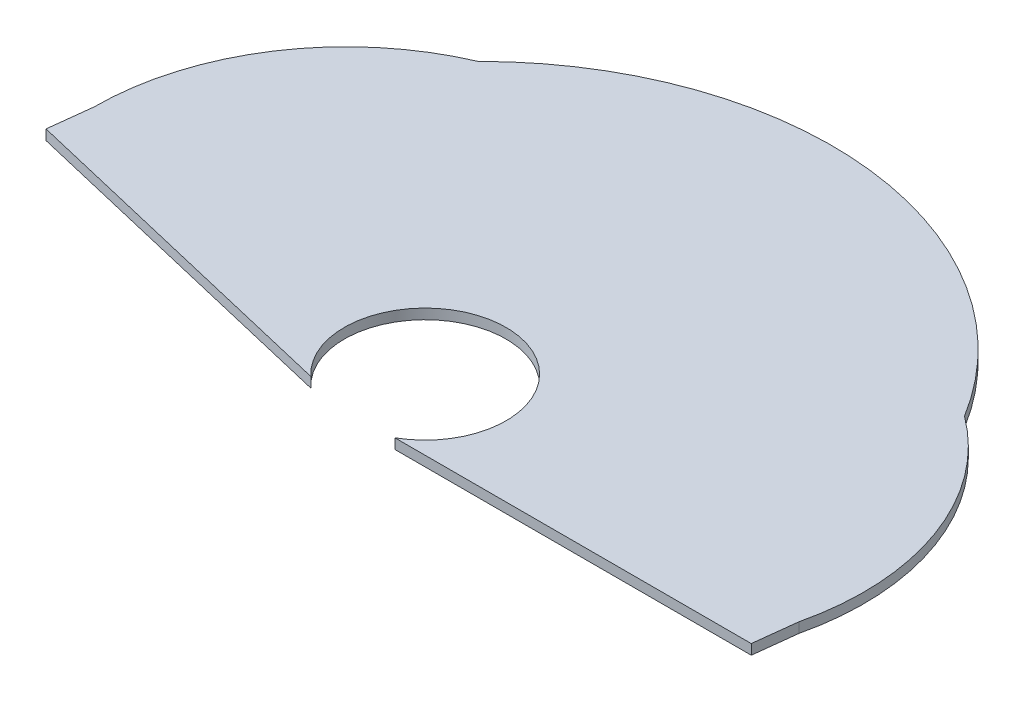
ISO-10303-21;
HEADER;
FILE_DESCRIPTION(('STEP AP214'),'2;1');
FILE_NAME('part.step','',(''),(''),'','','');
FILE_SCHEMA(('AUTOMOTIVE_DESIGN { 1 0 10303 214 1 1 1 1 }'));
ENDSEC;
DATA;
#1=APPLICATION_CONTEXT('core data for automotive mechanical design processes');
#2=APPLICATION_PROTOCOL_DEFINITION('international standard','automotive_design',2000,#1);
#3=PRODUCT_CONTEXT('',#1,'mechanical');
#4=PRODUCT('Part','Part','',(#3));
#5=PRODUCT_RELATED_PRODUCT_CATEGORY('part','',(#4));
#6=PRODUCT_DEFINITION_FORMATION('','',#4);
#7=PRODUCT_DEFINITION_CONTEXT('part definition',#1,'design');
#8=PRODUCT_DEFINITION('design','',#6,#7);
#9=PRODUCT_DEFINITION_SHAPE('','',#8);
#10=(LENGTH_UNIT() NAMED_UNIT(*) SI_UNIT(.MILLI.,.METRE.));
#11=(NAMED_UNIT(*) PLANE_ANGLE_UNIT() SI_UNIT($,.RADIAN.));
#12=(NAMED_UNIT(*) SI_UNIT($,.STERADIAN.) SOLID_ANGLE_UNIT());
#13=UNCERTAINTY_MEASURE_WITH_UNIT(LENGTH_MEASURE(1.E-05),#10,'distance_accuracy_value','');
#14=(GEOMETRIC_REPRESENTATION_CONTEXT(3) GLOBAL_UNCERTAINTY_ASSIGNED_CONTEXT((#13)) GLOBAL_UNIT_ASSIGNED_CONTEXT((#10,
#11,#12)) REPRESENTATION_CONTEXT('',''));
#15=CARTESIAN_POINT('',(0.,0.,0.));
#16=DIRECTION('',(0.,0.,1.));
#17=DIRECTION('',(1.,0.,0.));
#18=AXIS2_PLACEMENT_3D('',#15,#16,#17);
#19=CARTESIAN_POINT('',(12.47,0.5,0.));
#20=DIRECTION('',(0.,-1.,0.));
#21=DIRECTION('',(0.,0.,-1.));
#22=AXIS2_PLACEMENT_3D('',#19,#20,#21);
#23=CYLINDRICAL_SURFACE('',#22,12.47);
#24=CARTESIAN_POINT('',(12.47,0.,0.));
#25=DIRECTION('',(0.,1.,0.));
#26=DIRECTION('',(0.,0.,1.));
#27=AXIS2_PLACEMENT_3D('',#24,#25,#26);
#28=CIRCLE('',#27,12.47);
#29=CARTESIAN_POINT('',(7.54800553852922,0.,-11.4575246245099));
#30=VERTEX_POINT('',#29);
#31=CARTESIAN_POINT('',(0.,0.,0.));
#32=VERTEX_POINT('',#31);
#33=EDGE_CURVE('E152',#30,#32,#28,.T.);
#34=ORIENTED_EDGE('',*,*,#33,.T.);
#35=DIRECTION('',(0.,-1.,0.));
#36=VECTOR('',#35,1.);
#37=CARTESIAN_POINT('',(0.,0.5,0.));
#38=LINE('',#37,#36);
#39=CARTESIAN_POINT('',(0.,0.5,0.));
#40=VERTEX_POINT('',#39);
#41=EDGE_CURVE('E11',#40,#32,#38,.T.);
#42=ORIENTED_EDGE('',*,*,#41,.F.);
#43=CARTESIAN_POINT('',(12.47,0.5,0.));
#44=DIRECTION('',(0.,1.,0.));
#45=DIRECTION('',(0.,0.,1.));
#46=AXIS2_PLACEMENT_3D('',#43,#44,#45);
#47=CIRCLE('',#46,12.47);
#48=CARTESIAN_POINT('',(7.54800553852922,0.5,-11.4575246245099));
#49=VERTEX_POINT('',#48);
#50=EDGE_CURVE('E79',#49,#40,#47,.T.);
#51=ORIENTED_EDGE('',*,*,#50,.F.);
#52=DIRECTION('',(0.,-1.,0.));
#53=VECTOR('',#52,1.);
#54=CARTESIAN_POINT('',(7.54800553852922,0.5,-11.4575246245099));
#55=LINE('',#54,#53);
#56=EDGE_CURVE('E160',#49,#30,#55,.T.);
#57=ORIENTED_EDGE('',*,*,#56,.T.);
#58=EDGE_LOOP('',(#34,#42,#51,#57));
#59=FACE_BOUND('',#58,.T.);
#60=ADVANCED_FACE('F35',(#59),#23,.T.);
#61=CARTESIAN_POINT('',(27.3280369120115,0.5,1.73227452102643));
#62=DIRECTION('',(0.,-1.,0.));
#63=DIRECTION('',(0.,0.,-1.));
#64=AXIS2_PLACEMENT_3D('',#61,#62,#63);
#65=CYLINDRICAL_SURFACE('',#64,12.47);
#66=CARTESIAN_POINT('',(27.3280369120115,0.,1.73227452102643));
#67=DIRECTION('',(0.,1.,0.));
#68=DIRECTION('',(0.,0.,1.));
#69=AXIS2_PLACEMENT_3D('',#66,#67,#68);
#70=CIRCLE('',#69,12.47);
#71=CARTESIAN_POINT('',(39.4635774555418,0.,4.6009947437621));
#72=VERTEX_POINT('',#71);
#73=CARTESIAN_POINT('',(34.7538184625354,0.,-8.2856428455672));
#74=VERTEX_POINT('',#73);
#75=EDGE_CURVE('E68',#72,#74,#70,.T.);
#76=ORIENTED_EDGE('',*,*,#75,.T.);
#77=DIRECTION('',(0.,-1.,0.));
#78=VECTOR('',#77,1.);
#79=CARTESIAN_POINT('',(34.7538184625354,0.5,-8.2856428455672));
#80=LINE('',#79,#78);
#81=CARTESIAN_POINT('',(34.7538184625354,0.5,-8.2856428455672));
#82=VERTEX_POINT('',#81);
#83=EDGE_CURVE('E165',#82,#74,#80,.T.);
#84=ORIENTED_EDGE('',*,*,#83,.F.);
#85=CARTESIAN_POINT('',(27.3280369120115,0.5,1.73227452102643));
#86=DIRECTION('',(0.,1.,0.));
#87=DIRECTION('',(0.,0.,1.));
#88=AXIS2_PLACEMENT_3D('',#85,#86,#87);
#89=CIRCLE('',#88,12.47);
#90=CARTESIAN_POINT('',(39.4635774555418,0.5,4.6009947437621));
#91=VERTEX_POINT('',#90);
#92=EDGE_CURVE('E157',#91,#82,#89,.T.);
#93=ORIENTED_EDGE('',*,*,#92,.F.);
#94=DIRECTION('',(0.,-1.,0.));
#95=VECTOR('',#94,1.);
#96=CARTESIAN_POINT('',(39.4635774555418,0.5,4.6009947437621));
#97=LINE('',#96,#95);
#98=EDGE_CURVE('E43',#91,#72,#97,.T.);
#99=ORIENTED_EDGE('',*,*,#98,.T.);
#100=EDGE_LOOP('',(#76,#84,#93,#99));
#101=FACE_BOUND('',#100,.T.);
#102=ADVANCED_FACE('F167',(#101),#65,.T.);
#103=CARTESIAN_POINT('',(19.9027742115382,0.5,0.833923455105282));
#104=DIRECTION('',(0.,-1.,0.));
#105=DIRECTION('',(0.,0.,-1.));
#106=AXIS2_PLACEMENT_3D('',#103,#104,#105);
#107=CYLINDRICAL_SURFACE('',#106,17.4275645130764);
#108=CARTESIAN_POINT('',(19.9027742115382,0.,0.833923455105282));
#109=DIRECTION('',(0.,1.,0.));
#110=DIRECTION('',(0.,0.,-1.));
#111=AXIS2_PLACEMENT_3D('',#108,#109,#110);
#112=CIRCLE('',#111,17.4275645130764);
#113=EDGE_CURVE('E74',#74,#30,#112,.T.);
#114=ORIENTED_EDGE('',*,*,#113,.T.);
#115=ORIENTED_EDGE('',*,*,#56,.F.);
#116=CARTESIAN_POINT('',(19.9027742115382,0.5,0.833923455105282));
#117=DIRECTION('',(0.,1.,0.));
#118=DIRECTION('',(0.,0.,-1.));
#119=AXIS2_PLACEMENT_3D('',#116,#117,#118);
#120=CIRCLE('',#119,17.4275645130764);
#121=EDGE_CURVE('E51',#82,#49,#120,.T.);
#122=ORIENTED_EDGE('',*,*,#121,.F.);
#123=ORIENTED_EDGE('',*,*,#83,.T.);
#124=EDGE_LOOP('',(#114,#115,#122,#123));
#125=FACE_BOUND('',#124,.T.);
#126=ADVANCED_FACE('F180',(#125),#107,.T.);
#127=CARTESIAN_POINT('',(12.47,0.5,0.));
#128=DIRECTION('',(0.,1.,0.));
#129=DIRECTION('',(0.,0.,1.));
#130=AXIS2_PLACEMENT_3D('',#127,#128,#129);
#131=PLANE('',#130);
#132=DIRECTION('',(-0.115803987890991,0.,0.993272085779392));
#133=VECTOR('',#132,1.);
#134=CARTESIAN_POINT('',(39.4635774555418,0.5,4.60099474376226));
#135=LINE('',#134,#133);
#136=CARTESIAN_POINT('',(39.2168599821422,0.5,6.71713585310354));
#137=VERTEX_POINT('',#136);
#138=EDGE_CURVE('E140',#91,#137,#135,.T.);
#139=ORIENTED_EDGE('',*,*,#138,.F.);
#140=ORIENTED_EDGE('',*,*,#92,.T.);
#141=ORIENTED_EDGE('',*,*,#121,.T.);
#142=ORIENTED_EDGE('',*,*,#50,.T.);
#143=DIRECTION('',(-0.115803987891,0.,0.993272085779391));
#144=VECTOR('',#143,1.);
#145=CARTESIAN_POINT('',(0.,0.5,0.));
#146=LINE('',#145,#144);
#147=CARTESIAN_POINT('',(-0.246717473399619,0.5,2.11614110934175));
#148=VERTEX_POINT('',#147);
#149=EDGE_CURVE('E143',#40,#148,#146,.T.);
#150=ORIENTED_EDGE('',*,*,#149,.T.);
#151=DIRECTION('',(-0.973178872777091,0.,-0.230049737188094));
#152=VECTOR('',#151,1.);
#153=CARTESIAN_POINT('',(-0.486817706056994,0.5,2.05938381942648));
#154=LINE('',#153,#152);
#155=CARTESIAN_POINT('',(16.8970275713044,0.5,6.16875070895151));
#156=VERTEX_POINT('',#155);
#157=EDGE_CURVE('E125',#156,#148,#154,.T.);
#158=ORIENTED_EDGE('',*,*,#157,.F.);
#159=CARTESIAN_POINT('',(19.6221739397607,0.5,3.24068355287576));
#160=DIRECTION('',(0.,1.,0.));
#161=DIRECTION('',(0.,0.,1.));
#162=AXIS2_PLACEMENT_3D('',#159,#160,#161);
#163=CIRCLE('',#162,4.);
#164=CARTESIAN_POINT('',(21.6006277310432,0.5,6.71713585310362));
#165=VERTEX_POINT('',#164);
#166=EDGE_CURVE('E146',#165,#156,#163,.T.);
#167=ORIENTED_EDGE('',*,*,#166,.F.);
#168=DIRECTION('',(1.,0.,0.));
#169=VECTOR('',#168,1.);
#170=CARTESIAN_POINT('',(0.,0.5,6.71713585310371));
#171=LINE('',#170,#169);
#172=EDGE_CURVE('E134',#165,#137,#171,.T.);
#173=ORIENTED_EDGE('',*,*,#172,.T.);
#174=EDGE_LOOP('',(#139,#140,#141,#142,#150,#158,#167,#173));
#175=FACE_BOUND('',#174,.T.);
#176=ADVANCED_FACE('F179',(#175),#131,.T.);
#177=CARTESIAN_POINT('',(12.47,0.,0.));
#178=DIRECTION('',(0.,1.,0.));
#179=DIRECTION('',(0.,0.,1.));
#180=AXIS2_PLACEMENT_3D('',#177,#178,#179);
#181=PLANE('',#180);
#182=ORIENTED_EDGE('',*,*,#75,.F.);
#183=DIRECTION('',(-0.115803987890991,0.,0.993272085779392));
#184=VECTOR('',#183,1.);
#185=CARTESIAN_POINT('',(39.4635774555418,0.,4.60099474376226));
#186=LINE('',#185,#184);
#187=CARTESIAN_POINT('',(39.2168599821422,0.,6.71713585310354));
#188=VERTEX_POINT('',#187);
#189=EDGE_CURVE('E132',#72,#188,#186,.T.);
#190=ORIENTED_EDGE('',*,*,#189,.T.);
#191=DIRECTION('',(1.,0.,0.));
#192=VECTOR('',#191,1.);
#193=CARTESIAN_POINT('',(0.,0.,6.71713585310371));
#194=LINE('',#193,#192);
#195=CARTESIAN_POINT('',(21.6006277310432,0.,6.71713585310362));
#196=VERTEX_POINT('',#195);
#197=EDGE_CURVE('E129',#196,#188,#194,.T.);
#198=ORIENTED_EDGE('',*,*,#197,.F.);
#199=CARTESIAN_POINT('',(19.6221739397607,0.,3.24068355287576));
#200=DIRECTION('',(0.,1.,0.));
#201=DIRECTION('',(0.,0.,1.));
#202=AXIS2_PLACEMENT_3D('',#199,#200,#201);
#203=CIRCLE('',#202,4.);
#204=CARTESIAN_POINT('',(16.8970275713044,0.,6.16875070895151));
#205=VERTEX_POINT('',#204);
#206=EDGE_CURVE('E116',#196,#205,#203,.T.);
#207=ORIENTED_EDGE('',*,*,#206,.T.);
#208=DIRECTION('',(-0.973178872777091,0.,-0.230049737188094));
#209=VECTOR('',#208,1.);
#210=CARTESIAN_POINT('',(-0.486817706056994,0.,2.05938381942648));
#211=LINE('',#210,#209);
#212=CARTESIAN_POINT('',(-0.246717473399619,0.,2.11614110934175));
#213=VERTEX_POINT('',#212);
#214=EDGE_CURVE('E108',#205,#213,#211,.T.);
#215=ORIENTED_EDGE('',*,*,#214,.T.);
#216=DIRECTION('',(-0.115803987891,0.,0.993272085779391));
#217=VECTOR('',#216,1.);
#218=CARTESIAN_POINT('',(0.,0.,0.));
#219=LINE('',#218,#217);
#220=EDGE_CURVE('E113',#32,#213,#219,.T.);
#221=ORIENTED_EDGE('',*,*,#220,.F.);
#222=ORIENTED_EDGE('',*,*,#33,.F.);
#223=ORIENTED_EDGE('',*,*,#113,.F.);
#224=EDGE_LOOP('',(#182,#190,#198,#207,#215,#221,#222,#223));
#225=FACE_BOUND('',#224,.T.);
#226=ADVANCED_FACE('F110',(#225),#181,.F.);
#227=CARTESIAN_POINT('',(39.4635774555418,0.,4.60099474376226));
#228=DIRECTION('',(-0.993272085779392,0.,-0.115803987890991));
#229=DIRECTION('',(-0.115803987890991,0.,0.993272085779392));
#230=AXIS2_PLACEMENT_3D('',#227,#228,#229);
#231=PLANE('',#230);
#232=ORIENTED_EDGE('',*,*,#138,.T.);
#233=DIRECTION('',(0.,1.,0.));
#234=VECTOR('',#233,1.);
#235=CARTESIAN_POINT('',(39.2168599821422,0.,6.71713585310354));
#236=LINE('',#235,#234);
#237=EDGE_CURVE('E150',#188,#137,#236,.T.);
#238=ORIENTED_EDGE('',*,*,#237,.F.);
#239=ORIENTED_EDGE('',*,*,#189,.F.);
#240=ORIENTED_EDGE('',*,*,#98,.F.);
#241=EDGE_LOOP('',(#232,#238,#239,#240));
#242=FACE_BOUND('',#241,.T.);
#243=ADVANCED_FACE('F172',(#242),#231,.F.);
#244=CARTESIAN_POINT('',(0.,0.,6.71713585310371));
#245=DIRECTION('',(0.,0.,1.));
#246=DIRECTION('',(1.,0.,0.));
#247=AXIS2_PLACEMENT_3D('',#244,#245,#246);
#248=PLANE('',#247);
#249=ORIENTED_EDGE('',*,*,#172,.F.);
#250=DIRECTION('',(0.,1.,0.));
#251=VECTOR('',#250,1.);
#252=CARTESIAN_POINT('',(21.6006277310432,0.,6.71713585310362));
#253=LINE('',#252,#251);
#254=EDGE_CURVE('E153',#196,#165,#253,.T.);
#255=ORIENTED_EDGE('',*,*,#254,.F.);
#256=ORIENTED_EDGE('',*,*,#197,.T.);
#257=ORIENTED_EDGE('',*,*,#237,.T.);
#258=EDGE_LOOP('',(#249,#255,#256,#257));
#259=FACE_BOUND('',#258,.T.);
#260=ADVANCED_FACE('F175',(#259),#248,.T.);
#261=CARTESIAN_POINT('',(19.6221739397607,0.,3.24068355287576));
#262=DIRECTION('',(0.,1.,0.));
#263=DIRECTION('',(0.,0.,1.));
#264=AXIS2_PLACEMENT_3D('',#261,#262,#263);
#265=CYLINDRICAL_SURFACE('',#264,4.);
#266=ORIENTED_EDGE('',*,*,#166,.T.);
#267=DIRECTION('',(0.,1.,0.));
#268=VECTOR('',#267,1.);
#269=CARTESIAN_POINT('',(16.8970275713044,0.,6.16875070895151));
#270=LINE('',#269,#268);
#271=EDGE_CURVE('E128',#205,#156,#270,.T.);
#272=ORIENTED_EDGE('',*,*,#271,.F.);
#273=ORIENTED_EDGE('',*,*,#206,.F.);
#274=ORIENTED_EDGE('',*,*,#254,.T.);
#275=EDGE_LOOP('',(#266,#272,#273,#274));
#276=FACE_BOUND('',#275,.T.);
#277=ADVANCED_FACE('F178',(#276),#265,.F.);
#278=CARTESIAN_POINT('',(-0.486817706056994,0.,2.05938381942648));
#279=DIRECTION('',(0.230049737188094,0.,-0.973178872777091));
#280=DIRECTION('',(-0.973178872777091,0.,-0.230049737188094));
#281=AXIS2_PLACEMENT_3D('',#278,#279,#280);
#282=PLANE('',#281);
#283=ORIENTED_EDGE('',*,*,#157,.T.);
#284=DIRECTION('',(0.,1.,0.));
#285=VECTOR('',#284,1.);
#286=CARTESIAN_POINT('',(-0.246717473399619,0.,2.11614110934175));
#287=LINE('',#286,#285);
#288=EDGE_CURVE('E122',#213,#148,#287,.T.);
#289=ORIENTED_EDGE('',*,*,#288,.F.);
#290=ORIENTED_EDGE('',*,*,#214,.F.);
#291=ORIENTED_EDGE('',*,*,#271,.T.);
#292=EDGE_LOOP('',(#283,#289,#290,#291));
#293=FACE_BOUND('',#292,.T.);
#294=ADVANCED_FACE('F123',(#293),#282,.F.);
#295=CARTESIAN_POINT('',(0.,0.,0.));
#296=DIRECTION('',(-0.993272085779391,0.,-0.115803987891));
#297=DIRECTION('',(-0.115803987891,0.,0.993272085779391));
#298=AXIS2_PLACEMENT_3D('',#295,#296,#297);
#299=PLANE('',#298);
#300=ORIENTED_EDGE('',*,*,#149,.F.);
#301=ORIENTED_EDGE('',*,*,#41,.T.);
#302=ORIENTED_EDGE('',*,*,#220,.T.);
#303=ORIENTED_EDGE('',*,*,#288,.T.);
#304=EDGE_LOOP('',(#300,#301,#302,#303));
#305=FACE_BOUND('',#304,.T.);
#306=ADVANCED_FACE('F131',(#305),#299,.T.);
#307=CLOSED_SHELL('',(#60,#102,#126,#176,#226,#243,#260,#277,#294,#306));
#308=MANIFOLD_SOLID_BREP('B2',#307);
#309=ADVANCED_BREP_SHAPE_REPRESENTATION('',(#18,#308),#14);
#310=SHAPE_DEFINITION_REPRESENTATION(#9,#309);
ENDSEC;
END-ISO-10303-21;
